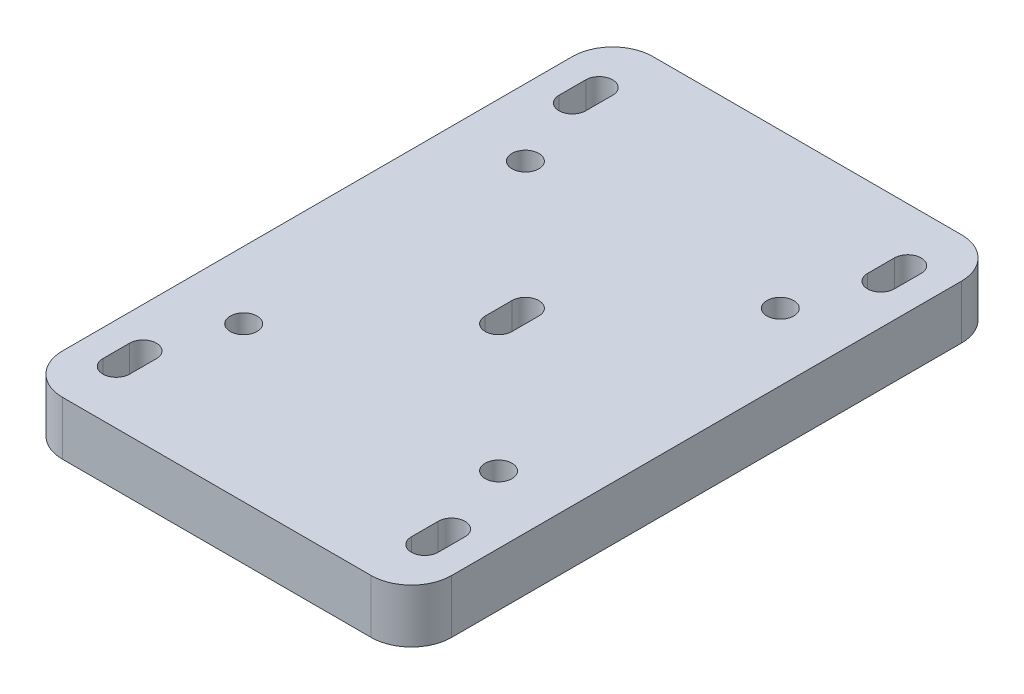
ISO-10303-21;
HEADER;
FILE_DESCRIPTION(('STEP AP214'),'2;1');
FILE_NAME('part.step','',(''),(''),'','','');
FILE_SCHEMA(('AUTOMOTIVE_DESIGN { 1 0 10303 214 1 1 1 1 }'));
ENDSEC;
DATA;
#1=APPLICATION_CONTEXT('core data for automotive mechanical design processes');
#2=APPLICATION_PROTOCOL_DEFINITION('international standard','automotive_design',2000,#1);
#3=PRODUCT_CONTEXT('',#1,'mechanical');
#4=PRODUCT('Part','Part','',(#3));
#5=PRODUCT_RELATED_PRODUCT_CATEGORY('part','',(#4));
#6=PRODUCT_DEFINITION_FORMATION('','',#4);
#7=PRODUCT_DEFINITION_CONTEXT('part definition',#1,'design');
#8=PRODUCT_DEFINITION('design','',#6,#7);
#9=PRODUCT_DEFINITION_SHAPE('','',#8);
#10=(LENGTH_UNIT() NAMED_UNIT(*) SI_UNIT(.MILLI.,.METRE.));
#11=(NAMED_UNIT(*) PLANE_ANGLE_UNIT() SI_UNIT($,.RADIAN.));
#12=(NAMED_UNIT(*) SI_UNIT($,.STERADIAN.) SOLID_ANGLE_UNIT());
#13=UNCERTAINTY_MEASURE_WITH_UNIT(LENGTH_MEASURE(1.E-05),#10,'distance_accuracy_value','');
#14=(GEOMETRIC_REPRESENTATION_CONTEXT(3) GLOBAL_UNCERTAINTY_ASSIGNED_CONTEXT((#13)) GLOBAL_UNIT_ASSIGNED_CONTEXT((#10,
#11,#12)) REPRESENTATION_CONTEXT('',''));
#15=CARTESIAN_POINT('',(0.,0.,0.));
#16=DIRECTION('',(0.,0.,1.));
#17=DIRECTION('',(1.,0.,0.));
#18=AXIS2_PLACEMENT_3D('',#15,#16,#17);
#19=CARTESIAN_POINT('',(0.,12.7,0.));
#20=DIRECTION('',(1.,0.,0.));
#21=DIRECTION('',(0.,0.,-1.));
#22=AXIS2_PLACEMENT_3D('',#19,#20,#21);
#23=PLANE('',#22);
#24=DIRECTION('',(0.,0.,1.));
#25=VECTOR('',#24,1.);
#26=CARTESIAN_POINT('',(0.,0.,0.));
#27=LINE('',#26,#25);
#28=CARTESIAN_POINT('',(0.,0.,-130.175));
#29=VERTEX_POINT('',#28);
#30=CARTESIAN_POINT('',(0.,0.,-9.525));
#31=VERTEX_POINT('',#30);
#32=EDGE_CURVE('E488',#29,#31,#27,.T.);
#33=ORIENTED_EDGE('',*,*,#32,.T.);
#34=DIRECTION('',(0.,-1.,0.));
#35=VECTOR('',#34,1.);
#36=CARTESIAN_POINT('',(0.,12.7,-9.525));
#37=LINE('',#36,#35);
#38=CARTESIAN_POINT('',(0.,12.7,-9.525));
#39=VERTEX_POINT('',#38);
#40=EDGE_CURVE('E558',#31,#39,#37,.F.);
#41=ORIENTED_EDGE('',*,*,#40,.T.);
#42=DIRECTION('',(0.,0.,1.));
#43=VECTOR('',#42,1.);
#44=CARTESIAN_POINT('',(0.,12.7,0.));
#45=LINE('',#44,#43);
#46=CARTESIAN_POINT('',(0.,12.7,-130.175));
#47=VERTEX_POINT('',#46);
#48=EDGE_CURVE('E489',#47,#39,#45,.T.);
#49=ORIENTED_EDGE('',*,*,#48,.F.);
#50=DIRECTION('',(0.,-1.,0.));
#51=VECTOR('',#50,1.);
#52=CARTESIAN_POINT('',(0.,12.7,-130.175));
#53=LINE('',#52,#51);
#54=EDGE_CURVE('E554',#47,#29,#53,.T.);
#55=ORIENTED_EDGE('',*,*,#54,.T.);
#56=EDGE_LOOP('',(#33,#41,#49,#55));
#57=FACE_BOUND('',#56,.T.);
#58=ADVANCED_FACE('F38',(#57),#23,.F.);
#59=CARTESIAN_POINT('',(0.,12.7,0.));
#60=DIRECTION('',(0.,0.,-1.));
#61=DIRECTION('',(-1.,0.,0.));
#62=AXIS2_PLACEMENT_3D('',#59,#60,#61);
#63=PLANE('',#62);
#64=DIRECTION('',(1.,0.,0.));
#65=VECTOR('',#64,1.);
#66=CARTESIAN_POINT('',(0.,0.,0.));
#67=LINE('',#66,#65);
#68=CARTESIAN_POINT('',(9.525,0.,0.));
#69=VERTEX_POINT('',#68);
#70=CARTESIAN_POINT('',(82.55,0.,0.));
#71=VERTEX_POINT('',#70);
#72=EDGE_CURVE('E508',#69,#71,#67,.T.);
#73=ORIENTED_EDGE('',*,*,#72,.T.);
#74=DIRECTION('',(0.,-1.,0.));
#75=VECTOR('',#74,1.);
#76=CARTESIAN_POINT('',(82.55,12.7,0.));
#77=LINE('',#76,#75);
#78=CARTESIAN_POINT('',(82.55,12.7,0.));
#79=VERTEX_POINT('',#78);
#80=EDGE_CURVE('E540',#71,#79,#77,.F.);
#81=ORIENTED_EDGE('',*,*,#80,.T.);
#82=DIRECTION('',(1.,0.,0.));
#83=VECTOR('',#82,1.);
#84=CARTESIAN_POINT('',(0.,12.7,0.));
#85=LINE('',#84,#83);
#86=CARTESIAN_POINT('',(9.525,12.7,0.));
#87=VERTEX_POINT('',#86);
#88=EDGE_CURVE('E493',#87,#79,#85,.T.);
#89=ORIENTED_EDGE('',*,*,#88,.F.);
#90=DIRECTION('',(0.,-1.,0.));
#91=VECTOR('',#90,1.);
#92=CARTESIAN_POINT('',(9.525,12.7,0.));
#93=LINE('',#92,#91);
#94=EDGE_CURVE('E536',#87,#69,#93,.T.);
#95=ORIENTED_EDGE('',*,*,#94,.T.);
#96=EDGE_LOOP('',(#73,#81,#89,#95));
#97=FACE_BOUND('',#96,.T.);
#98=ADVANCED_FACE('F584',(#97),#63,.F.);
#99=CARTESIAN_POINT('',(92.075,12.7,0.));
#100=DIRECTION('',(-1.,0.,0.));
#101=DIRECTION('',(0.,0.,1.));
#102=AXIS2_PLACEMENT_3D('',#99,#100,#101);
#103=PLANE('',#102);
#104=DIRECTION('',(0.,0.,-1.));
#105=VECTOR('',#104,1.);
#106=CARTESIAN_POINT('',(92.075,12.7,0.));
#107=LINE('',#106,#105);
#108=CARTESIAN_POINT('',(92.075,12.7,-9.525));
#109=VERTEX_POINT('',#108);
#110=CARTESIAN_POINT('',(92.075,12.7,-130.175));
#111=VERTEX_POINT('',#110);
#112=EDGE_CURVE('E498',#109,#111,#107,.T.);
#113=ORIENTED_EDGE('',*,*,#112,.F.);
#114=DIRECTION('',(0.,-1.,0.));
#115=VECTOR('',#114,1.);
#116=CARTESIAN_POINT('',(92.075,12.7,-9.525));
#117=LINE('',#116,#115);
#118=CARTESIAN_POINT('',(92.075,0.,-9.525));
#119=VERTEX_POINT('',#118);
#120=EDGE_CURVE('E520',#109,#119,#117,.T.);
#121=ORIENTED_EDGE('',*,*,#120,.T.);
#122=DIRECTION('',(0.,0.,-1.));
#123=VECTOR('',#122,1.);
#124=CARTESIAN_POINT('',(92.075,0.,0.));
#125=LINE('',#124,#123);
#126=CARTESIAN_POINT('',(92.075,0.,-130.175));
#127=VERTEX_POINT('',#126);
#128=EDGE_CURVE('E512',#119,#127,#125,.T.);
#129=ORIENTED_EDGE('',*,*,#128,.T.);
#130=DIRECTION('',(0.,-1.,0.));
#131=VECTOR('',#130,1.);
#132=CARTESIAN_POINT('',(92.075,12.7,-130.175));
#133=LINE('',#132,#131);
#134=EDGE_CURVE('E504',#127,#111,#133,.F.);
#135=ORIENTED_EDGE('',*,*,#134,.T.);
#136=EDGE_LOOP('',(#113,#121,#129,#135));
#137=FACE_BOUND('',#136,.T.);
#138=ADVANCED_FACE('F592',(#137),#103,.F.);
#139=CARTESIAN_POINT('',(0.,12.7,-139.7));
#140=DIRECTION('',(0.,0.,1.));
#141=DIRECTION('',(1.,0.,0.));
#142=AXIS2_PLACEMENT_3D('',#139,#140,#141);
#143=PLANE('',#142);
#144=DIRECTION('',(-1.,0.,0.));
#145=VECTOR('',#144,1.);
#146=CARTESIAN_POINT('',(0.,0.,-139.7));
#147=LINE('',#146,#145);
#148=CARTESIAN_POINT('',(82.55,0.,-139.7));
#149=VERTEX_POINT('',#148);
#150=CARTESIAN_POINT('',(9.525,0.,-139.7));
#151=VERTEX_POINT('',#150);
#152=EDGE_CURVE('E494',#149,#151,#147,.T.);
#153=ORIENTED_EDGE('',*,*,#152,.T.);
#154=DIRECTION('',(0.,-1.,0.));
#155=VECTOR('',#154,1.);
#156=CARTESIAN_POINT('',(9.525,12.7,-139.7));
#157=LINE('',#156,#155);
#158=CARTESIAN_POINT('',(9.525,12.7,-139.7));
#159=VERTEX_POINT('',#158);
#160=EDGE_CURVE('E11',#151,#159,#157,.F.);
#161=ORIENTED_EDGE('',*,*,#160,.T.);
#162=DIRECTION('',(-1.,0.,0.));
#163=VECTOR('',#162,1.);
#164=CARTESIAN_POINT('',(0.,12.7,-139.7));
#165=LINE('',#164,#163);
#166=CARTESIAN_POINT('',(82.55,12.7,-139.7));
#167=VERTEX_POINT('',#166);
#168=EDGE_CURVE('E501',#167,#159,#165,.T.);
#169=ORIENTED_EDGE('',*,*,#168,.F.);
#170=DIRECTION('',(0.,-1.,0.));
#171=VECTOR('',#170,1.);
#172=CARTESIAN_POINT('',(82.55,12.7,-139.7));
#173=LINE('',#172,#171);
#174=EDGE_CURVE('E47',#167,#149,#173,.T.);
#175=ORIENTED_EDGE('',*,*,#174,.T.);
#176=EDGE_LOOP('',(#153,#161,#169,#175));
#177=FACE_BOUND('',#176,.T.);
#178=ADVANCED_FACE('F564',(#177),#143,.F.);
#179=CARTESIAN_POINT('',(0.,12.7,0.));
#180=DIRECTION('',(0.,-1.,0.));
#181=DIRECTION('',(0.,0.,-1.));
#182=AXIS2_PLACEMENT_3D('',#179,#180,#181);
#183=PLANE('',#182);
#184=DIRECTION('',(0.,0.,1.));
#185=VECTOR('',#184,1.);
#186=CARTESIAN_POINT('',(6.34999999999999,12.7,-19.05));
#187=LINE('',#186,#185);
#188=CARTESIAN_POINT('',(6.34999999999999,12.7,-19.05));
#189=VERTEX_POINT('',#188);
#190=CARTESIAN_POINT('',(6.34999999999999,12.7,-12.7));
#191=VERTEX_POINT('',#190);
#192=EDGE_CURVE('E346',#189,#191,#187,.T.);
#193=ORIENTED_EDGE('',*,*,#192,.F.);
#194=CARTESIAN_POINT('',(9.52499999999999,12.7,-19.05));
#195=DIRECTION('',(0.,1.,0.));
#196=DIRECTION('',(0.,0.,1.));
#197=AXIS2_PLACEMENT_3D('',#194,#195,#196);
#198=CIRCLE('',#197,3.175);
#199=CARTESIAN_POINT('',(12.7,12.7,-19.05));
#200=VERTEX_POINT('',#199);
#201=EDGE_CURVE('E343',#200,#189,#198,.T.);
#202=ORIENTED_EDGE('',*,*,#201,.F.);
#203=DIRECTION('',(0.,0.,-1.));
#204=VECTOR('',#203,1.);
#205=CARTESIAN_POINT('',(12.7,12.7,-19.05));
#206=LINE('',#205,#204);
#207=CARTESIAN_POINT('',(12.7,12.7,-12.7));
#208=VERTEX_POINT('',#207);
#209=EDGE_CURVE('E330',#208,#200,#206,.T.);
#210=ORIENTED_EDGE('',*,*,#209,.F.);
#211=CARTESIAN_POINT('',(9.525,12.7,-12.7));
#212=DIRECTION('',(0.,1.,0.));
#213=DIRECTION('',(0.,0.,1.));
#214=AXIS2_PLACEMENT_3D('',#211,#212,#213);
#215=CIRCLE('',#214,3.175);
#216=EDGE_CURVE('E350',#191,#208,#215,.T.);
#217=ORIENTED_EDGE('',*,*,#216,.F.);
#218=EDGE_LOOP('',(#193,#202,#210,#217));
#219=FACE_BOUND('',#218,.T.);
#220=DIRECTION('',(0.,0.,1.));
#221=VECTOR('',#220,1.);
#222=CARTESIAN_POINT('',(79.375,12.7,-19.05));
#223=LINE('',#222,#221);
#224=CARTESIAN_POINT('',(79.375,12.7,-19.05));
#225=VERTEX_POINT('',#224);
#226=CARTESIAN_POINT('',(79.375,12.7,-12.7));
#227=VERTEX_POINT('',#226);
#228=EDGE_CURVE('E302',#225,#227,#223,.T.);
#229=ORIENTED_EDGE('',*,*,#228,.F.);
#230=CARTESIAN_POINT('',(82.55,12.7,-19.05));
#231=DIRECTION('',(0.,1.,0.));
#232=DIRECTION('',(0.,0.,1.));
#233=AXIS2_PLACEMENT_3D('',#230,#231,#232);
#234=CIRCLE('',#233,3.175);
#235=CARTESIAN_POINT('',(85.7250000000001,12.7,-19.05));
#236=VERTEX_POINT('',#235);
#237=EDGE_CURVE('E299',#236,#225,#234,.T.);
#238=ORIENTED_EDGE('',*,*,#237,.F.);
#239=DIRECTION('',(0.,0.,-1.));
#240=VECTOR('',#239,1.);
#241=CARTESIAN_POINT('',(85.7250000000001,12.7,-19.05));
#242=LINE('',#241,#240);
#243=CARTESIAN_POINT('',(85.7250000000001,12.7,-12.7));
#244=VERTEX_POINT('',#243);
#245=EDGE_CURVE('E286',#244,#236,#242,.T.);
#246=ORIENTED_EDGE('',*,*,#245,.F.);
#247=CARTESIAN_POINT('',(82.55,12.7,-12.7));
#248=DIRECTION('',(0.,1.,0.));
#249=DIRECTION('',(0.,0.,1.));
#250=AXIS2_PLACEMENT_3D('',#247,#248,#249);
#251=CIRCLE('',#250,3.175);
#252=EDGE_CURVE('E307',#227,#244,#251,.T.);
#253=ORIENTED_EDGE('',*,*,#252,.F.);
#254=EDGE_LOOP('',(#229,#238,#246,#253));
#255=FACE_BOUND('',#254,.T.);
#256=DIRECTION('',(0.,0.,1.));
#257=VECTOR('',#256,1.);
#258=CARTESIAN_POINT('',(79.375,12.7,-127.));
#259=LINE('',#258,#257);
#260=CARTESIAN_POINT('',(79.375,12.7,-127.));
#261=VERTEX_POINT('',#260);
#262=CARTESIAN_POINT('',(79.375,12.7,-120.65));
#263=VERTEX_POINT('',#262);
#264=EDGE_CURVE('E265',#261,#263,#259,.T.);
#265=ORIENTED_EDGE('',*,*,#264,.F.);
#266=CARTESIAN_POINT('',(82.55,12.7,-127.));
#267=DIRECTION('',(0.,1.,0.));
#268=DIRECTION('',(0.,0.,1.));
#269=AXIS2_PLACEMENT_3D('',#266,#267,#268);
#270=CIRCLE('',#269,3.175);
#271=CARTESIAN_POINT('',(85.7250000000001,12.7,-127.));
#272=VERTEX_POINT('',#271);
#273=EDGE_CURVE('E231',#272,#261,#270,.T.);
#274=ORIENTED_EDGE('',*,*,#273,.F.);
#275=DIRECTION('',(0.,0.,-1.));
#276=VECTOR('',#275,1.);
#277=CARTESIAN_POINT('',(85.7250000000001,12.7,-127.));
#278=LINE('',#277,#276);
#279=CARTESIAN_POINT('',(85.7250000000001,12.7,-120.65));
#280=VERTEX_POINT('',#279);
#281=EDGE_CURVE('E252',#280,#272,#278,.T.);
#282=ORIENTED_EDGE('',*,*,#281,.F.);
#283=CARTESIAN_POINT('',(82.55,12.7,-120.65));
#284=DIRECTION('',(0.,1.,0.));
#285=DIRECTION('',(0.,0.,1.));
#286=AXIS2_PLACEMENT_3D('',#283,#284,#285);
#287=CIRCLE('',#286,3.175);
#288=EDGE_CURVE('E256',#263,#280,#287,.T.);
#289=ORIENTED_EDGE('',*,*,#288,.F.);
#290=EDGE_LOOP('',(#265,#274,#282,#289));
#291=FACE_BOUND('',#290,.T.);
#292=DIRECTION('',(0.,0.,1.));
#293=VECTOR('',#292,1.);
#294=CARTESIAN_POINT('',(6.34999999999999,12.7,-127.));
#295=LINE('',#294,#293);
#296=CARTESIAN_POINT('',(6.34999999999999,12.7,-127.));
#297=VERTEX_POINT('',#296);
#298=CARTESIAN_POINT('',(6.34999999999999,12.7,-120.65));
#299=VERTEX_POINT('',#298);
#300=EDGE_CURVE('E433',#297,#299,#295,.T.);
#301=ORIENTED_EDGE('',*,*,#300,.F.);
#302=CARTESIAN_POINT('',(9.52499999999999,12.7,-127.));
#303=DIRECTION('',(0.,1.,0.));
#304=DIRECTION('',(0.,0.,1.));
#305=AXIS2_PLACEMENT_3D('',#302,#303,#304);
#306=CIRCLE('',#305,3.175);
#307=CARTESIAN_POINT('',(12.7,12.7,-127.));
#308=VERTEX_POINT('',#307);
#309=EDGE_CURVE('E401',#308,#297,#306,.T.);
#310=ORIENTED_EDGE('',*,*,#309,.F.);
#311=DIRECTION('',(0.,0.,-1.));
#312=VECTOR('',#311,1.);
#313=CARTESIAN_POINT('',(12.7,12.7,-127.));
#314=LINE('',#313,#312);
#315=CARTESIAN_POINT('',(12.7,12.7,-120.65));
#316=VERTEX_POINT('',#315);
#317=EDGE_CURVE('E418',#316,#308,#314,.T.);
#318=ORIENTED_EDGE('',*,*,#317,.F.);
#319=CARTESIAN_POINT('',(9.525,12.7,-120.65));
#320=DIRECTION('',(0.,1.,0.));
#321=DIRECTION('',(0.,0.,1.));
#322=AXIS2_PLACEMENT_3D('',#319,#320,#321);
#323=CIRCLE('',#322,3.175);
#324=EDGE_CURVE('E437',#299,#316,#323,.T.);
#325=ORIENTED_EDGE('',*,*,#324,.F.);
#326=EDGE_LOOP('',(#301,#310,#318,#325));
#327=FACE_BOUND('',#326,.T.);
#328=DIRECTION('',(0.,0.,1.));
#329=VECTOR('',#328,1.);
#330=CARTESIAN_POINT('',(42.8625,12.7,-73.025));
#331=LINE('',#330,#329);
#332=CARTESIAN_POINT('',(42.8625,12.7,-73.025));
#333=VERTEX_POINT('',#332);
#334=CARTESIAN_POINT('',(42.8625,12.7,-66.675));
#335=VERTEX_POINT('',#334);
#336=EDGE_CURVE('E388',#333,#335,#331,.T.);
#337=ORIENTED_EDGE('',*,*,#336,.F.);
#338=CARTESIAN_POINT('',(46.0375,12.7,-73.025));
#339=DIRECTION('',(0.,1.,0.));
#340=DIRECTION('',(0.,0.,1.));
#341=AXIS2_PLACEMENT_3D('',#338,#339,#340);
#342=CIRCLE('',#341,3.175);
#343=CARTESIAN_POINT('',(49.2125,12.7,-73.025));
#344=VERTEX_POINT('',#343);
#345=EDGE_CURVE('E275',#344,#333,#342,.T.);
#346=ORIENTED_EDGE('',*,*,#345,.F.);
#347=DIRECTION('',(0.,0.,-1.));
#348=VECTOR('',#347,1.);
#349=CARTESIAN_POINT('',(49.2125,12.7,-73.025));
#350=LINE('',#349,#348);
#351=CARTESIAN_POINT('',(49.2125,12.7,-66.675));
#352=VERTEX_POINT('',#351);
#353=EDGE_CURVE('E373',#352,#344,#350,.T.);
#354=ORIENTED_EDGE('',*,*,#353,.F.);
#355=CARTESIAN_POINT('',(46.0375,12.7,-66.675));
#356=DIRECTION('',(0.,1.,0.));
#357=DIRECTION('',(0.,0.,1.));
#358=AXIS2_PLACEMENT_3D('',#355,#356,#357);
#359=CIRCLE('',#358,3.175);
#360=EDGE_CURVE('E391',#335,#352,#359,.T.);
#361=ORIENTED_EDGE('',*,*,#360,.F.);
#362=EDGE_LOOP('',(#337,#346,#354,#361));
#363=FACE_BOUND('',#362,.T.);
#364=CARTESIAN_POINT('',(76.2,12.7,-103.1875));
#365=DIRECTION('',(0.,1.,0.));
#366=DIRECTION('',(0.,0.,1.));
#367=AXIS2_PLACEMENT_3D('',#364,#365,#366);
#368=CIRCLE('',#367,3.175);
#369=CARTESIAN_POINT('',(76.2,12.7,-100.0125));
#370=VERTEX_POINT('',#369);
#371=EDGE_CURVE('E447',#370,#370,#368,.T.);
#372=ORIENTED_EDGE('',*,*,#371,.F.);
#373=EDGE_LOOP('',(#372));
#374=FACE_BOUND('',#373,.T.);
#375=CARTESIAN_POINT('',(15.875,12.7,-36.5125));
#376=DIRECTION('',(0.,1.,0.));
#377=DIRECTION('',(0.,0.,1.));
#378=AXIS2_PLACEMENT_3D('',#375,#376,#377);
#379=CIRCLE('',#378,3.175);
#380=CARTESIAN_POINT('',(15.875,12.7,-33.3375));
#381=VERTEX_POINT('',#380);
#382=EDGE_CURVE('E464',#381,#381,#379,.T.);
#383=ORIENTED_EDGE('',*,*,#382,.F.);
#384=EDGE_LOOP('',(#383));
#385=FACE_BOUND('',#384,.T.);
#386=CARTESIAN_POINT('',(15.875,12.7,-103.1875));
#387=DIRECTION('',(0.,1.,0.));
#388=DIRECTION('',(0.,0.,1.));
#389=AXIS2_PLACEMENT_3D('',#386,#387,#388);
#390=CIRCLE('',#389,3.175);
#391=CARTESIAN_POINT('',(15.875,12.7,-100.0125));
#392=VERTEX_POINT('',#391);
#393=EDGE_CURVE('E472',#392,#392,#390,.T.);
#394=ORIENTED_EDGE('',*,*,#393,.F.);
#395=EDGE_LOOP('',(#394));
#396=FACE_BOUND('',#395,.T.);
#397=CARTESIAN_POINT('',(76.2,12.7,-36.5125));
#398=DIRECTION('',(0.,1.,0.));
#399=DIRECTION('',(0.,0.,1.));
#400=AXIS2_PLACEMENT_3D('',#397,#398,#399);
#401=CIRCLE('',#400,3.175);
#402=CARTESIAN_POINT('',(76.2,12.7,-33.3375));
#403=VERTEX_POINT('',#402);
#404=EDGE_CURVE('E480',#403,#403,#401,.T.);
#405=ORIENTED_EDGE('',*,*,#404,.F.);
#406=EDGE_LOOP('',(#405));
#407=FACE_BOUND('',#406,.T.);
#408=ORIENTED_EDGE('',*,*,#88,.T.);
#409=CARTESIAN_POINT('',(82.55,12.7,-9.525));
#410=DIRECTION('',(0.,-1.,0.));
#411=DIRECTION('',(0.,0.,-1.));
#412=AXIS2_PLACEMENT_3D('',#409,#410,#411);
#413=CIRCLE('',#412,9.525);
#414=EDGE_CURVE('E551',#79,#109,#413,.F.);
#415=ORIENTED_EDGE('',*,*,#414,.T.);
#416=ORIENTED_EDGE('',*,*,#112,.T.);
#417=CARTESIAN_POINT('',(82.55,12.7,-130.175));
#418=DIRECTION('',(0.,-1.,0.));
#419=DIRECTION('',(0.,0.,-1.));
#420=AXIS2_PLACEMENT_3D('',#417,#418,#419);
#421=CIRCLE('',#420,9.525);
#422=EDGE_CURVE('E59',#111,#167,#421,.F.);
#423=ORIENTED_EDGE('',*,*,#422,.T.);
#424=ORIENTED_EDGE('',*,*,#168,.T.);
#425=CARTESIAN_POINT('',(9.525,12.7,-130.175));
#426=DIRECTION('',(0.,-1.,0.));
#427=DIRECTION('',(0.,0.,-1.));
#428=AXIS2_PLACEMENT_3D('',#425,#426,#427);
#429=CIRCLE('',#428,9.525);
#430=EDGE_CURVE('E545',#159,#47,#429,.F.);
#431=ORIENTED_EDGE('',*,*,#430,.T.);
#432=ORIENTED_EDGE('',*,*,#48,.T.);
#433=CARTESIAN_POINT('',(9.525,12.7,-9.525));
#434=DIRECTION('',(0.,-1.,0.));
#435=DIRECTION('',(0.,0.,-1.));
#436=AXIS2_PLACEMENT_3D('',#433,#434,#435);
#437=CIRCLE('',#436,9.525);
#438=EDGE_CURVE('E548',#39,#87,#437,.F.);
#439=ORIENTED_EDGE('',*,*,#438,.T.);
#440=EDGE_LOOP('',(#408,#415,#416,#423,#424,#431,#432,#439));
#441=FACE_BOUND('',#440,.T.);
#442=ADVANCED_FACE('F577',(#219,#255,#291,#327,#363,#374,#385,#396,#407,#441),#183,.F.);
#443=CARTESIAN_POINT('',(0.,0.,0.));
#444=DIRECTION('',(0.,-1.,0.));
#445=DIRECTION('',(0.,0.,-1.));
#446=AXIS2_PLACEMENT_3D('',#443,#444,#445);
#447=PLANE('',#446);
#448=CARTESIAN_POINT('',(9.52499999999999,0.,-19.05));
#449=DIRECTION('',(0.,1.,0.));
#450=DIRECTION('',(0.,0.,1.));
#451=AXIS2_PLACEMENT_3D('',#448,#449,#450);
#452=CIRCLE('',#451,3.175);
#453=CARTESIAN_POINT('',(12.7,0.,-19.05));
#454=VERTEX_POINT('',#453);
#455=CARTESIAN_POINT('',(6.34999999999999,0.,-19.05));
#456=VERTEX_POINT('',#455);
#457=EDGE_CURVE('E325',#454,#456,#452,.T.);
#458=ORIENTED_EDGE('',*,*,#457,.T.);
#459=DIRECTION('',(0.,0.,1.));
#460=VECTOR('',#459,1.);
#461=CARTESIAN_POINT('',(6.34999999999999,0.,-19.05));
#462=LINE('',#461,#460);
#463=CARTESIAN_POINT('',(6.35,0.,-12.7));
#464=VERTEX_POINT('',#463);
#465=EDGE_CURVE('E329',#456,#464,#462,.T.);
#466=ORIENTED_EDGE('',*,*,#465,.T.);
#467=CARTESIAN_POINT('',(9.525,0.,-12.7));
#468=DIRECTION('',(0.,1.,0.));
#469=DIRECTION('',(0.,0.,1.));
#470=AXIS2_PLACEMENT_3D('',#467,#468,#469);
#471=CIRCLE('',#470,3.175);
#472=CARTESIAN_POINT('',(12.7,0.,-12.7));
#473=VERTEX_POINT('',#472);
#474=EDGE_CURVE('E334',#464,#473,#471,.T.);
#475=ORIENTED_EDGE('',*,*,#474,.T.);
#476=DIRECTION('',(0.,0.,-1.));
#477=VECTOR('',#476,1.);
#478=CARTESIAN_POINT('',(12.7,0.,-19.05));
#479=LINE('',#478,#477);
#480=EDGE_CURVE('E338',#473,#454,#479,.T.);
#481=ORIENTED_EDGE('',*,*,#480,.T.);
#482=EDGE_LOOP('',(#458,#466,#475,#481));
#483=FACE_BOUND('',#482,.T.);
#484=CARTESIAN_POINT('',(82.55,0.,-19.05));
#485=DIRECTION('',(0.,1.,0.));
#486=DIRECTION('',(0.,0.,1.));
#487=AXIS2_PLACEMENT_3D('',#484,#485,#486);
#488=CIRCLE('',#487,3.175);
#489=CARTESIAN_POINT('',(85.7250000000001,0.,-19.05));
#490=VERTEX_POINT('',#489);
#491=CARTESIAN_POINT('',(79.375,0.,-19.05));
#492=VERTEX_POINT('',#491);
#493=EDGE_CURVE('E281',#490,#492,#488,.T.);
#494=ORIENTED_EDGE('',*,*,#493,.T.);
#495=DIRECTION('',(0.,0.,1.));
#496=VECTOR('',#495,1.);
#497=CARTESIAN_POINT('',(79.375,0.,-19.05));
#498=LINE('',#497,#496);
#499=CARTESIAN_POINT('',(79.375,0.,-12.7));
#500=VERTEX_POINT('',#499);
#501=EDGE_CURVE('E285',#492,#500,#498,.T.);
#502=ORIENTED_EDGE('',*,*,#501,.T.);
#503=CARTESIAN_POINT('',(82.55,0.,-12.7));
#504=DIRECTION('',(0.,1.,0.));
#505=DIRECTION('',(0.,0.,1.));
#506=AXIS2_PLACEMENT_3D('',#503,#504,#505);
#507=CIRCLE('',#506,3.175);
#508=CARTESIAN_POINT('',(85.7250000000001,0.,-12.7));
#509=VERTEX_POINT('',#508);
#510=EDGE_CURVE('E290',#500,#509,#507,.T.);
#511=ORIENTED_EDGE('',*,*,#510,.T.);
#512=DIRECTION('',(0.,0.,-1.));
#513=VECTOR('',#512,1.);
#514=CARTESIAN_POINT('',(85.7250000000001,0.,-19.05));
#515=LINE('',#514,#513);
#516=EDGE_CURVE('E294',#509,#490,#515,.T.);
#517=ORIENTED_EDGE('',*,*,#516,.T.);
#518=EDGE_LOOP('',(#494,#502,#511,#517));
#519=FACE_BOUND('',#518,.T.);
#520=CARTESIAN_POINT('',(82.55,0.,-127.));
#521=DIRECTION('',(0.,1.,0.));
#522=DIRECTION('',(0.,0.,1.));
#523=AXIS2_PLACEMENT_3D('',#520,#521,#522);
#524=CIRCLE('',#523,3.175);
#525=CARTESIAN_POINT('',(85.7250000000001,0.,-127.));
#526=VERTEX_POINT('',#525);
#527=CARTESIAN_POINT('',(79.375,0.,-127.));
#528=VERTEX_POINT('',#527);
#529=EDGE_CURVE('E228',#526,#528,#524,.T.);
#530=ORIENTED_EDGE('',*,*,#529,.T.);
#531=DIRECTION('',(0.,0.,1.));
#532=VECTOR('',#531,1.);
#533=CARTESIAN_POINT('',(79.375,0.,-127.));
#534=LINE('',#533,#532);
#535=CARTESIAN_POINT('',(79.375,0.,-120.65));
#536=VERTEX_POINT('',#535);
#537=EDGE_CURVE('E241',#528,#536,#534,.T.);
#538=ORIENTED_EDGE('',*,*,#537,.T.);
#539=CARTESIAN_POINT('',(82.55,0.,-120.65));
#540=DIRECTION('',(0.,1.,0.));
#541=DIRECTION('',(0.,0.,1.));
#542=AXIS2_PLACEMENT_3D('',#539,#540,#541);
#543=CIRCLE('',#542,3.175);
#544=CARTESIAN_POINT('',(85.7250000000001,0.,-120.65));
#545=VERTEX_POINT('',#544);
#546=EDGE_CURVE('E246',#536,#545,#543,.T.);
#547=ORIENTED_EDGE('',*,*,#546,.T.);
#548=DIRECTION('',(0.,0.,-1.));
#549=VECTOR('',#548,1.);
#550=CARTESIAN_POINT('',(85.7250000000001,0.,-127.));
#551=LINE('',#550,#549);
#552=EDGE_CURVE('E237',#545,#526,#551,.T.);
#553=ORIENTED_EDGE('',*,*,#552,.T.);
#554=EDGE_LOOP('',(#530,#538,#547,#553));
#555=FACE_BOUND('',#554,.T.);
#556=CARTESIAN_POINT('',(46.0375,0.,-73.025));
#557=DIRECTION('',(0.,1.,0.));
#558=DIRECTION('',(0.,0.,1.));
#559=AXIS2_PLACEMENT_3D('',#556,#557,#558);
#560=CIRCLE('',#559,3.175);
#561=CARTESIAN_POINT('',(49.2125,0.,-73.025));
#562=VERTEX_POINT('',#561);
#563=CARTESIAN_POINT('',(42.8625,0.,-73.025));
#564=VERTEX_POINT('',#563);
#565=EDGE_CURVE('E368',#562,#564,#560,.T.);
#566=ORIENTED_EDGE('',*,*,#565,.T.);
#567=DIRECTION('',(0.,0.,1.));
#568=VECTOR('',#567,1.);
#569=CARTESIAN_POINT('',(42.8625,0.,-73.025));
#570=LINE('',#569,#568);
#571=CARTESIAN_POINT('',(42.8625,0.,-66.675));
#572=VERTEX_POINT('',#571);
#573=EDGE_CURVE('E372',#564,#572,#570,.T.);
#574=ORIENTED_EDGE('',*,*,#573,.T.);
#575=CARTESIAN_POINT('',(46.0375,0.,-66.675));
#576=DIRECTION('',(0.,1.,0.));
#577=DIRECTION('',(0.,0.,1.));
#578=AXIS2_PLACEMENT_3D('',#575,#576,#577);
#579=CIRCLE('',#578,3.175);
#580=CARTESIAN_POINT('',(49.2125,0.,-66.675));
#581=VERTEX_POINT('',#580);
#582=EDGE_CURVE('E377',#572,#581,#579,.T.);
#583=ORIENTED_EDGE('',*,*,#582,.T.);
#584=DIRECTION('',(0.,0.,-1.));
#585=VECTOR('',#584,1.);
#586=CARTESIAN_POINT('',(49.2125,0.,-73.025));
#587=LINE('',#586,#585);
#588=EDGE_CURVE('E381',#581,#562,#587,.T.);
#589=ORIENTED_EDGE('',*,*,#588,.T.);
#590=EDGE_LOOP('',(#566,#574,#583,#589));
#591=FACE_BOUND('',#590,.T.);
#592=CARTESIAN_POINT('',(9.52499999999999,0.,-127.));
#593=DIRECTION('',(0.,1.,0.));
#594=DIRECTION('',(0.,0.,1.));
#595=AXIS2_PLACEMENT_3D('',#592,#593,#594);
#596=CIRCLE('',#595,3.175);
#597=CARTESIAN_POINT('',(12.7,0.,-127.));
#598=VERTEX_POINT('',#597);
#599=CARTESIAN_POINT('',(6.34999999999999,0.,-127.));
#600=VERTEX_POINT('',#599);
#601=EDGE_CURVE('E413',#598,#600,#596,.T.);
#602=ORIENTED_EDGE('',*,*,#601,.T.);
#603=DIRECTION('',(0.,0.,1.));
#604=VECTOR('',#603,1.);
#605=CARTESIAN_POINT('',(6.34999999999999,0.,-127.));
#606=LINE('',#605,#604);
#607=CARTESIAN_POINT('',(6.35,0.,-120.65));
#608=VERTEX_POINT('',#607);
#609=EDGE_CURVE('E417',#600,#608,#606,.T.);
#610=ORIENTED_EDGE('',*,*,#609,.T.);
#611=CARTESIAN_POINT('',(9.525,0.,-120.65));
#612=DIRECTION('',(0.,1.,0.));
#613=DIRECTION('',(0.,0.,1.));
#614=AXIS2_PLACEMENT_3D('',#611,#612,#613);
#615=CIRCLE('',#614,3.175);
#616=CARTESIAN_POINT('',(12.7,0.,-120.65));
#617=VERTEX_POINT('',#616);
#618=EDGE_CURVE('E422',#608,#617,#615,.T.);
#619=ORIENTED_EDGE('',*,*,#618,.T.);
#620=DIRECTION('',(0.,0.,-1.));
#621=VECTOR('',#620,1.);
#622=CARTESIAN_POINT('',(12.7,0.,-127.));
#623=LINE('',#622,#621);
#624=EDGE_CURVE('E426',#617,#598,#623,.T.);
#625=ORIENTED_EDGE('',*,*,#624,.T.);
#626=EDGE_LOOP('',(#602,#610,#619,#625));
#627=FACE_BOUND('',#626,.T.);
#628=CARTESIAN_POINT('',(76.2,0.,-103.1875));
#629=DIRECTION('',(0.,1.,0.));
#630=DIRECTION('',(0.,0.,1.));
#631=AXIS2_PLACEMENT_3D('',#628,#629,#630);
#632=CIRCLE('',#631,3.175);
#633=CARTESIAN_POINT('',(76.2,0.,-100.0125));
#634=VERTEX_POINT('',#633);
#635=EDGE_CURVE('E460',#634,#634,#632,.T.);
#636=ORIENTED_EDGE('',*,*,#635,.T.);
#637=EDGE_LOOP('',(#636));
#638=FACE_BOUND('',#637,.T.);
#639=CARTESIAN_POINT('',(15.875,0.,-36.5125));
#640=DIRECTION('',(0.,1.,0.));
#641=DIRECTION('',(0.,0.,1.));
#642=AXIS2_PLACEMENT_3D('',#639,#640,#641);
#643=CIRCLE('',#642,3.175);
#644=CARTESIAN_POINT('',(15.875,0.,-33.3375));
#645=VERTEX_POINT('',#644);
#646=EDGE_CURVE('E468',#645,#645,#643,.T.);
#647=ORIENTED_EDGE('',*,*,#646,.T.);
#648=EDGE_LOOP('',(#647));
#649=FACE_BOUND('',#648,.T.);
#650=CARTESIAN_POINT('',(15.875,0.,-103.1875));
#651=DIRECTION('',(0.,1.,0.));
#652=DIRECTION('',(0.,0.,1.));
#653=AXIS2_PLACEMENT_3D('',#650,#651,#652);
#654=CIRCLE('',#653,3.175);
#655=CARTESIAN_POINT('',(15.875,0.,-100.0125));
#656=VERTEX_POINT('',#655);
#657=EDGE_CURVE('E476',#656,#656,#654,.T.);
#658=ORIENTED_EDGE('',*,*,#657,.T.);
#659=EDGE_LOOP('',(#658));
#660=FACE_BOUND('',#659,.T.);
#661=CARTESIAN_POINT('',(76.2,0.,-36.5125));
#662=DIRECTION('',(0.,1.,0.));
#663=DIRECTION('',(0.,0.,1.));
#664=AXIS2_PLACEMENT_3D('',#661,#662,#663);
#665=CIRCLE('',#664,3.175);
#666=CARTESIAN_POINT('',(76.2,0.,-33.3375));
#667=VERTEX_POINT('',#666);
#668=EDGE_CURVE('E484',#667,#667,#665,.T.);
#669=ORIENTED_EDGE('',*,*,#668,.T.);
#670=EDGE_LOOP('',(#669));
#671=FACE_BOUND('',#670,.T.);
#672=ORIENTED_EDGE('',*,*,#128,.F.);
#673=CARTESIAN_POINT('',(82.55,0.,-9.525));
#674=DIRECTION('',(0.,-1.,0.));
#675=DIRECTION('',(0.,0.,-1.));
#676=AXIS2_PLACEMENT_3D('',#673,#674,#675);
#677=CIRCLE('',#676,9.525);
#678=EDGE_CURVE('E533',#119,#71,#677,.T.);
#679=ORIENTED_EDGE('',*,*,#678,.T.);
#680=ORIENTED_EDGE('',*,*,#72,.F.);
#681=CARTESIAN_POINT('',(9.525,0.,-9.525));
#682=DIRECTION('',(0.,-1.,0.));
#683=DIRECTION('',(0.,0.,-1.));
#684=AXIS2_PLACEMENT_3D('',#681,#682,#683);
#685=CIRCLE('',#684,9.525);
#686=EDGE_CURVE('E530',#69,#31,#685,.T.);
#687=ORIENTED_EDGE('',*,*,#686,.T.);
#688=ORIENTED_EDGE('',*,*,#32,.F.);
#689=CARTESIAN_POINT('',(9.525,0.,-130.175));
#690=DIRECTION('',(0.,-1.,0.));
#691=DIRECTION('',(0.,0.,-1.));
#692=AXIS2_PLACEMENT_3D('',#689,#690,#691);
#693=CIRCLE('',#692,9.525);
#694=EDGE_CURVE('E527',#29,#151,#693,.T.);
#695=ORIENTED_EDGE('',*,*,#694,.T.);
#696=ORIENTED_EDGE('',*,*,#152,.F.);
#697=CARTESIAN_POINT('',(82.55,0.,-130.175));
#698=DIRECTION('',(0.,-1.,0.));
#699=DIRECTION('',(0.,0.,-1.));
#700=AXIS2_PLACEMENT_3D('',#697,#698,#699);
#701=CIRCLE('',#700,9.525);
#702=EDGE_CURVE('E524',#149,#127,#701,.T.);
#703=ORIENTED_EDGE('',*,*,#702,.T.);
#704=EDGE_LOOP('',(#672,#679,#680,#687,#688,#695,#696,#703));
#705=FACE_BOUND('',#704,.T.);
#706=ADVANCED_FACE('F248',(#483,#519,#555,#591,#627,#638,#649,#660,#671,#705),#447,.T.);
#707=CARTESIAN_POINT('',(76.2,12.7,-36.5125));
#708=DIRECTION('',(0.,1.,0.));
#709=DIRECTION('',(0.,0.,1.));
#710=AXIS2_PLACEMENT_3D('',#707,#708,#709);
#711=CYLINDRICAL_SURFACE('',#710,3.175);
#712=ORIENTED_EDGE('',*,*,#668,.F.);
#713=EDGE_LOOP('',(#712));
#714=FACE_BOUND('',#713,.T.);
#715=ORIENTED_EDGE('',*,*,#404,.T.);
#716=EDGE_LOOP('',(#715));
#717=FACE_BOUND('',#716,.T.);
#718=ADVANCED_FACE('F833',(#714,#717),#711,.F.);
#719=CARTESIAN_POINT('',(15.875,12.7,-103.1875));
#720=DIRECTION('',(0.,1.,0.));
#721=DIRECTION('',(0.,0.,1.));
#722=AXIS2_PLACEMENT_3D('',#719,#720,#721);
#723=CYLINDRICAL_SURFACE('',#722,3.175);
#724=ORIENTED_EDGE('',*,*,#657,.F.);
#725=EDGE_LOOP('',(#724));
#726=FACE_BOUND('',#725,.T.);
#727=ORIENTED_EDGE('',*,*,#393,.T.);
#728=EDGE_LOOP('',(#727));
#729=FACE_BOUND('',#728,.T.);
#730=ADVANCED_FACE('F824',(#726,#729),#723,.F.);
#731=CARTESIAN_POINT('',(15.875,12.7,-36.5125));
#732=DIRECTION('',(0.,1.,0.));
#733=DIRECTION('',(0.,0.,1.));
#734=AXIS2_PLACEMENT_3D('',#731,#732,#733);
#735=CYLINDRICAL_SURFACE('',#734,3.175);
#736=ORIENTED_EDGE('',*,*,#646,.F.);
#737=EDGE_LOOP('',(#736));
#738=FACE_BOUND('',#737,.T.);
#739=ORIENTED_EDGE('',*,*,#382,.T.);
#740=EDGE_LOOP('',(#739));
#741=FACE_BOUND('',#740,.T.);
#742=ADVANCED_FACE('F815',(#738,#741),#735,.F.);
#743=CARTESIAN_POINT('',(76.2,12.7,-103.1875));
#744=DIRECTION('',(0.,1.,0.));
#745=DIRECTION('',(0.,0.,1.));
#746=AXIS2_PLACEMENT_3D('',#743,#744,#745);
#747=CYLINDRICAL_SURFACE('',#746,3.175);
#748=ORIENTED_EDGE('',*,*,#635,.F.);
#749=EDGE_LOOP('',(#748));
#750=FACE_BOUND('',#749,.T.);
#751=ORIENTED_EDGE('',*,*,#371,.T.);
#752=EDGE_LOOP('',(#751));
#753=FACE_BOUND('',#752,.T.);
#754=ADVANCED_FACE('F806',(#750,#753),#747,.F.);
#755=CARTESIAN_POINT('',(9.52499999999999,0.,-127.));
#756=DIRECTION('',(0.,1.,0.));
#757=DIRECTION('',(0.,0.,1.));
#758=AXIS2_PLACEMENT_3D('',#755,#756,#757);
#759=CYLINDRICAL_SURFACE('',#758,3.175);
#760=ORIENTED_EDGE('',*,*,#309,.T.);
#761=DIRECTION('',(0.,1.,0.));
#762=VECTOR('',#761,1.);
#763=CARTESIAN_POINT('',(6.34999999999999,0.,-127.));
#764=LINE('',#763,#762);
#765=EDGE_CURVE('E430',#600,#297,#764,.T.);
#766=ORIENTED_EDGE('',*,*,#765,.F.);
#767=ORIENTED_EDGE('',*,*,#601,.F.);
#768=DIRECTION('',(0.,1.,0.));
#769=VECTOR('',#768,1.);
#770=CARTESIAN_POINT('',(12.7,0.,-127.));
#771=LINE('',#770,#769);
#772=EDGE_CURVE('E444',#598,#308,#771,.T.);
#773=ORIENTED_EDGE('',*,*,#772,.T.);
#774=EDGE_LOOP('',(#760,#766,#767,#773));
#775=FACE_BOUND('',#774,.T.);
#776=ADVANCED_FACE('F797',(#775),#759,.F.);
#777=CARTESIAN_POINT('',(12.7,0.,-127.));
#778=DIRECTION('',(1.,0.,0.));
#779=DIRECTION('',(0.,0.,-1.));
#780=AXIS2_PLACEMENT_3D('',#777,#778,#779);
#781=PLANE('',#780);
#782=ORIENTED_EDGE('',*,*,#317,.T.);
#783=ORIENTED_EDGE('',*,*,#772,.F.);
#784=ORIENTED_EDGE('',*,*,#624,.F.);
#785=DIRECTION('',(0.,1.,0.));
#786=VECTOR('',#785,1.);
#787=CARTESIAN_POINT('',(12.7,0.,-120.65));
#788=LINE('',#787,#786);
#789=EDGE_CURVE('E448',#617,#316,#788,.T.);
#790=ORIENTED_EDGE('',*,*,#789,.T.);
#791=EDGE_LOOP('',(#782,#783,#784,#790));
#792=FACE_BOUND('',#791,.T.);
#793=ADVANCED_FACE('F788',(#792),#781,.F.);
#794=CARTESIAN_POINT('',(9.525,0.,-120.65));
#795=DIRECTION('',(0.,1.,0.));
#796=DIRECTION('',(0.,0.,1.));
#797=AXIS2_PLACEMENT_3D('',#794,#795,#796);
#798=CYLINDRICAL_SURFACE('',#797,3.175);
#799=ORIENTED_EDGE('',*,*,#324,.T.);
#800=ORIENTED_EDGE('',*,*,#789,.F.);
#801=ORIENTED_EDGE('',*,*,#618,.F.);
#802=DIRECTION('',(0.,1.,0.));
#803=VECTOR('',#802,1.);
#804=CARTESIAN_POINT('',(6.34999999999999,0.,-120.65));
#805=LINE('',#804,#803);
#806=EDGE_CURVE('E451',#608,#299,#805,.T.);
#807=ORIENTED_EDGE('',*,*,#806,.T.);
#808=EDGE_LOOP('',(#799,#800,#801,#807));
#809=FACE_BOUND('',#808,.T.);
#810=ADVANCED_FACE('F779',(#809),#798,.F.);
#811=CARTESIAN_POINT('',(6.34999999999999,0.,-127.));
#812=DIRECTION('',(-1.,0.,0.));
#813=DIRECTION('',(0.,0.,1.));
#814=AXIS2_PLACEMENT_3D('',#811,#812,#813);
#815=PLANE('',#814);
#816=ORIENTED_EDGE('',*,*,#300,.T.);
#817=ORIENTED_EDGE('',*,*,#806,.F.);
#818=ORIENTED_EDGE('',*,*,#609,.F.);
#819=ORIENTED_EDGE('',*,*,#765,.T.);
#820=EDGE_LOOP('',(#816,#817,#818,#819));
#821=FACE_BOUND('',#820,.T.);
#822=ADVANCED_FACE('F770',(#821),#815,.F.);
#823=CARTESIAN_POINT('',(49.2125,0.,-73.025));
#824=DIRECTION('',(1.,0.,0.));
#825=DIRECTION('',(0.,0.,-1.));
#826=AXIS2_PLACEMENT_3D('',#823,#824,#825);
#827=PLANE('',#826);
#828=ORIENTED_EDGE('',*,*,#353,.T.);
#829=DIRECTION('',(0.,1.,0.));
#830=VECTOR('',#829,1.);
#831=CARTESIAN_POINT('',(49.2125,0.,-73.025));
#832=LINE('',#831,#830);
#833=EDGE_CURVE('E397',#562,#344,#832,.T.);
#834=ORIENTED_EDGE('',*,*,#833,.F.);
#835=ORIENTED_EDGE('',*,*,#588,.F.);
#836=DIRECTION('',(0.,1.,0.));
#837=VECTOR('',#836,1.);
#838=CARTESIAN_POINT('',(49.2125,0.,-66.675));
#839=LINE('',#838,#837);
#840=EDGE_CURVE('E402',#581,#352,#839,.T.);
#841=ORIENTED_EDGE('',*,*,#840,.T.);
#842=EDGE_LOOP('',(#828,#834,#835,#841));
#843=FACE_BOUND('',#842,.T.);
#844=ADVANCED_FACE('F761',(#843),#827,.F.);
#845=CARTESIAN_POINT('',(42.8625,0.,-73.025));
#846=DIRECTION('',(-1.,0.,0.));
#847=DIRECTION('',(0.,0.,1.));
#848=AXIS2_PLACEMENT_3D('',#845,#846,#847);
#849=PLANE('',#848);
#850=ORIENTED_EDGE('',*,*,#336,.T.);
#851=DIRECTION('',(0.,1.,0.));
#852=VECTOR('',#851,1.);
#853=CARTESIAN_POINT('',(42.8625,0.,-66.675));
#854=LINE('',#853,#852);
#855=EDGE_CURVE('E406',#572,#335,#854,.T.);
#856=ORIENTED_EDGE('',*,*,#855,.F.);
#857=ORIENTED_EDGE('',*,*,#573,.F.);
#858=DIRECTION('',(0.,1.,0.));
#859=VECTOR('',#858,1.);
#860=CARTESIAN_POINT('',(42.8625,0.,-73.025));
#861=LINE('',#860,#859);
#862=EDGE_CURVE('E385',#564,#333,#861,.T.);
#863=ORIENTED_EDGE('',*,*,#862,.T.);
#864=EDGE_LOOP('',(#850,#856,#857,#863));
#865=FACE_BOUND('',#864,.T.);
#866=ADVANCED_FACE('F752',(#865),#849,.F.);
#867=CARTESIAN_POINT('',(46.0375,0.,-73.025));
#868=DIRECTION('',(0.,1.,0.));
#869=DIRECTION('',(0.,0.,1.));
#870=AXIS2_PLACEMENT_3D('',#867,#868,#869);
#871=CYLINDRICAL_SURFACE('',#870,3.175);
#872=ORIENTED_EDGE('',*,*,#345,.T.);
#873=ORIENTED_EDGE('',*,*,#862,.F.);
#874=ORIENTED_EDGE('',*,*,#565,.F.);
#875=ORIENTED_EDGE('',*,*,#833,.T.);
#876=EDGE_LOOP('',(#872,#873,#874,#875));
#877=FACE_BOUND('',#876,.T.);
#878=ADVANCED_FACE('F743',(#877),#871,.F.);
#879=CARTESIAN_POINT('',(46.0375,0.,-66.675));
#880=DIRECTION('',(0.,1.,0.));
#881=DIRECTION('',(0.,0.,1.));
#882=AXIS2_PLACEMENT_3D('',#879,#880,#881);
#883=CYLINDRICAL_SURFACE('',#882,3.175);
#884=ORIENTED_EDGE('',*,*,#360,.T.);
#885=ORIENTED_EDGE('',*,*,#840,.F.);
#886=ORIENTED_EDGE('',*,*,#582,.F.);
#887=ORIENTED_EDGE('',*,*,#855,.T.);
#888=EDGE_LOOP('',(#884,#885,#886,#887));
#889=FACE_BOUND('',#888,.T.);
#890=ADVANCED_FACE('F735',(#889),#883,.F.);
#891=CARTESIAN_POINT('',(82.55,0.,-127.));
#892=DIRECTION('',(0.,1.,0.));
#893=DIRECTION('',(0.,0.,1.));
#894=AXIS2_PLACEMENT_3D('',#891,#892,#893);
#895=CYLINDRICAL_SURFACE('',#894,3.175);
#896=ORIENTED_EDGE('',*,*,#273,.T.);
#897=DIRECTION('',(0.,1.,0.));
#898=VECTOR('',#897,1.);
#899=CARTESIAN_POINT('',(79.375,0.,-127.));
#900=LINE('',#899,#898);
#901=EDGE_CURVE('E224',#528,#261,#900,.T.);
#902=ORIENTED_EDGE('',*,*,#901,.F.);
#903=ORIENTED_EDGE('',*,*,#529,.F.);
#904=DIRECTION('',(0.,1.,0.));
#905=VECTOR('',#904,1.);
#906=CARTESIAN_POINT('',(85.7250000000001,0.,-127.));
#907=LINE('',#906,#905);
#908=EDGE_CURVE('E272',#526,#272,#907,.T.);
#909=ORIENTED_EDGE('',*,*,#908,.T.);
#910=EDGE_LOOP('',(#896,#902,#903,#909));
#911=FACE_BOUND('',#910,.T.);
#912=ADVANCED_FACE('F226',(#911),#895,.F.);
#913=CARTESIAN_POINT('',(85.7250000000001,0.,-127.));
#914=DIRECTION('',(1.,0.,0.));
#915=DIRECTION('',(0.,0.,-1.));
#916=AXIS2_PLACEMENT_3D('',#913,#914,#915);
#917=PLANE('',#916);
#918=ORIENTED_EDGE('',*,*,#281,.T.);
#919=ORIENTED_EDGE('',*,*,#908,.F.);
#920=ORIENTED_EDGE('',*,*,#552,.F.);
#921=DIRECTION('',(0.,1.,0.));
#922=VECTOR('',#921,1.);
#923=CARTESIAN_POINT('',(85.7250000000001,0.,-120.65));
#924=LINE('',#923,#922);
#925=EDGE_CURVE('E276',#545,#280,#924,.T.);
#926=ORIENTED_EDGE('',*,*,#925,.T.);
#927=EDGE_LOOP('',(#918,#919,#920,#926));
#928=FACE_BOUND('',#927,.T.);
#929=ADVANCED_FACE('F718',(#928),#917,.F.);
#930=CARTESIAN_POINT('',(82.55,0.,-120.65));
#931=DIRECTION('',(0.,1.,0.));
#932=DIRECTION('',(0.,0.,1.));
#933=AXIS2_PLACEMENT_3D('',#930,#931,#932);
#934=CYLINDRICAL_SURFACE('',#933,3.175);
#935=ORIENTED_EDGE('',*,*,#288,.T.);
#936=ORIENTED_EDGE('',*,*,#925,.F.);
#937=ORIENTED_EDGE('',*,*,#546,.F.);
#938=DIRECTION('',(0.,1.,0.));
#939=VECTOR('',#938,1.);
#940=CARTESIAN_POINT('',(79.375,0.,-120.65));
#941=LINE('',#940,#939);
#942=EDGE_CURVE('E236',#536,#263,#941,.T.);
#943=ORIENTED_EDGE('',*,*,#942,.T.);
#944=EDGE_LOOP('',(#935,#936,#937,#943));
#945=FACE_BOUND('',#944,.T.);
#946=ADVANCED_FACE('F710',(#945),#934,.F.);
#947=CARTESIAN_POINT('',(79.375,0.,-127.));
#948=DIRECTION('',(-1.,0.,0.));
#949=DIRECTION('',(0.,0.,1.));
#950=AXIS2_PLACEMENT_3D('',#947,#948,#949);
#951=PLANE('',#950);
#952=ORIENTED_EDGE('',*,*,#264,.T.);
#953=ORIENTED_EDGE('',*,*,#942,.F.);
#954=ORIENTED_EDGE('',*,*,#537,.F.);
#955=ORIENTED_EDGE('',*,*,#901,.T.);
#956=EDGE_LOOP('',(#952,#953,#954,#955));
#957=FACE_BOUND('',#956,.T.);
#958=ADVANCED_FACE('F242',(#957),#951,.F.);
#959=CARTESIAN_POINT('',(82.55,0.,-19.05));
#960=DIRECTION('',(0.,1.,0.));
#961=DIRECTION('',(0.,0.,1.));
#962=AXIS2_PLACEMENT_3D('',#959,#960,#961);
#963=CYLINDRICAL_SURFACE('',#962,3.175);
#964=ORIENTED_EDGE('',*,*,#237,.T.);
#965=DIRECTION('',(0.,1.,0.));
#966=VECTOR('',#965,1.);
#967=CARTESIAN_POINT('',(79.375,0.,-19.05));
#968=LINE('',#967,#966);
#969=EDGE_CURVE('E298',#492,#225,#968,.T.);
#970=ORIENTED_EDGE('',*,*,#969,.F.);
#971=ORIENTED_EDGE('',*,*,#493,.F.);
#972=DIRECTION('',(0.,1.,0.));
#973=VECTOR('',#972,1.);
#974=CARTESIAN_POINT('',(85.7250000000001,0.,-19.05));
#975=LINE('',#974,#973);
#976=EDGE_CURVE('E266',#490,#236,#975,.T.);
#977=ORIENTED_EDGE('',*,*,#976,.T.);
#978=EDGE_LOOP('',(#964,#970,#971,#977));
#979=FACE_BOUND('',#978,.T.);
#980=ADVANCED_FACE('F693',(#979),#963,.F.);
#981=CARTESIAN_POINT('',(85.7250000000001,0.,-19.05));
#982=DIRECTION('',(1.,0.,0.));
#983=DIRECTION('',(0.,0.,-1.));
#984=AXIS2_PLACEMENT_3D('',#981,#982,#983);
#985=PLANE('',#984);
#986=ORIENTED_EDGE('',*,*,#245,.T.);
#987=ORIENTED_EDGE('',*,*,#976,.F.);
#988=ORIENTED_EDGE('',*,*,#516,.F.);
#989=DIRECTION('',(0.,1.,0.));
#990=VECTOR('',#989,1.);
#991=CARTESIAN_POINT('',(85.7250000000001,0.,-12.7));
#992=LINE('',#991,#990);
#993=EDGE_CURVE('E316',#509,#244,#992,.T.);
#994=ORIENTED_EDGE('',*,*,#993,.T.);
#995=EDGE_LOOP('',(#986,#987,#988,#994));
#996=FACE_BOUND('',#995,.T.);
#997=ADVANCED_FACE('F684',(#996),#985,.F.);
#998=CARTESIAN_POINT('',(82.55,0.,-12.7));
#999=DIRECTION('',(0.,1.,0.));
#1000=DIRECTION('',(0.,0.,1.));
#1001=AXIS2_PLACEMENT_3D('',#998,#999,#1000);
#1002=CYLINDRICAL_SURFACE('',#1001,3.175);
#1003=ORIENTED_EDGE('',*,*,#252,.T.);
#1004=ORIENTED_EDGE('',*,*,#993,.F.);
#1005=ORIENTED_EDGE('',*,*,#510,.F.);
#1006=DIRECTION('',(0.,1.,0.));
#1007=VECTOR('',#1006,1.);
#1008=CARTESIAN_POINT('',(79.375,0.,-12.7));
#1009=LINE('',#1008,#1007);
#1010=EDGE_CURVE('E319',#500,#227,#1009,.T.);
#1011=ORIENTED_EDGE('',*,*,#1010,.T.);
#1012=EDGE_LOOP('',(#1003,#1004,#1005,#1011));
#1013=FACE_BOUND('',#1012,.T.);
#1014=ADVANCED_FACE('F675',(#1013),#1002,.F.);
#1015=CARTESIAN_POINT('',(79.375,0.,-19.05));
#1016=DIRECTION('',(-1.,0.,0.));
#1017=DIRECTION('',(0.,0.,1.));
#1018=AXIS2_PLACEMENT_3D('',#1015,#1016,#1017);
#1019=PLANE('',#1018);
#1020=ORIENTED_EDGE('',*,*,#228,.T.);
#1021=ORIENTED_EDGE('',*,*,#1010,.F.);
#1022=ORIENTED_EDGE('',*,*,#501,.F.);
#1023=ORIENTED_EDGE('',*,*,#969,.T.);
#1024=EDGE_LOOP('',(#1020,#1021,#1022,#1023));
#1025=FACE_BOUND('',#1024,.T.);
#1026=ADVANCED_FACE('F666',(#1025),#1019,.F.);
#1027=CARTESIAN_POINT('',(9.52499999999999,0.,-19.05));
#1028=DIRECTION('',(0.,1.,0.));
#1029=DIRECTION('',(0.,0.,1.));
#1030=AXIS2_PLACEMENT_3D('',#1027,#1028,#1029);
#1031=CYLINDRICAL_SURFACE('',#1030,3.175);
#1032=ORIENTED_EDGE('',*,*,#201,.T.);
#1033=DIRECTION('',(0.,1.,0.));
#1034=VECTOR('',#1033,1.);
#1035=CARTESIAN_POINT('',(6.34999999999999,0.,-19.05));
#1036=LINE('',#1035,#1034);
#1037=EDGE_CURVE('E342',#456,#189,#1036,.T.);
#1038=ORIENTED_EDGE('',*,*,#1037,.F.);
#1039=ORIENTED_EDGE('',*,*,#457,.F.);
#1040=DIRECTION('',(0.,1.,0.));
#1041=VECTOR('',#1040,1.);
#1042=CARTESIAN_POINT('',(12.7,0.,-19.05));
#1043=LINE('',#1042,#1041);
#1044=EDGE_CURVE('E303',#454,#200,#1043,.T.);
#1045=ORIENTED_EDGE('',*,*,#1044,.T.);
#1046=EDGE_LOOP('',(#1032,#1038,#1039,#1045));
#1047=FACE_BOUND('',#1046,.T.);
#1048=ADVANCED_FACE('F657',(#1047),#1031,.F.);
#1049=CARTESIAN_POINT('',(12.7,0.,-19.05));
#1050=DIRECTION('',(1.,0.,0.));
#1051=DIRECTION('',(0.,0.,-1.));
#1052=AXIS2_PLACEMENT_3D('',#1049,#1050,#1051);
#1053=PLANE('',#1052);
#1054=ORIENTED_EDGE('',*,*,#209,.T.);
#1055=ORIENTED_EDGE('',*,*,#1044,.F.);
#1056=ORIENTED_EDGE('',*,*,#480,.F.);
#1057=DIRECTION('',(0.,1.,0.));
#1058=VECTOR('',#1057,1.);
#1059=CARTESIAN_POINT('',(12.7,0.,-12.7));
#1060=LINE('',#1059,#1058);
#1061=EDGE_CURVE('E359',#473,#208,#1060,.T.);
#1062=ORIENTED_EDGE('',*,*,#1061,.T.);
#1063=EDGE_LOOP('',(#1054,#1055,#1056,#1062));
#1064=FACE_BOUND('',#1063,.T.);
#1065=ADVANCED_FACE('F648',(#1064),#1053,.F.);
#1066=CARTESIAN_POINT('',(9.525,0.,-12.7));
#1067=DIRECTION('',(0.,1.,0.));
#1068=DIRECTION('',(0.,0.,1.));
#1069=AXIS2_PLACEMENT_3D('',#1066,#1067,#1068);
#1070=CYLINDRICAL_SURFACE('',#1069,3.175);
#1071=ORIENTED_EDGE('',*,*,#216,.T.);
#1072=ORIENTED_EDGE('',*,*,#1061,.F.);
#1073=ORIENTED_EDGE('',*,*,#474,.F.);
#1074=DIRECTION('',(0.,1.,0.));
#1075=VECTOR('',#1074,1.);
#1076=CARTESIAN_POINT('',(6.34999999999999,0.,-12.7));
#1077=LINE('',#1076,#1075);
#1078=EDGE_CURVE('E362',#464,#191,#1077,.T.);
#1079=ORIENTED_EDGE('',*,*,#1078,.T.);
#1080=EDGE_LOOP('',(#1071,#1072,#1073,#1079));
#1081=FACE_BOUND('',#1080,.T.);
#1082=ADVANCED_FACE('F639',(#1081),#1070,.F.);
#1083=CARTESIAN_POINT('',(6.34999999999999,0.,-19.05));
#1084=DIRECTION('',(-1.,0.,0.));
#1085=DIRECTION('',(0.,0.,1.));
#1086=AXIS2_PLACEMENT_3D('',#1083,#1084,#1085);
#1087=PLANE('',#1086);
#1088=ORIENTED_EDGE('',*,*,#192,.T.);
#1089=ORIENTED_EDGE('',*,*,#1078,.F.);
#1090=ORIENTED_EDGE('',*,*,#465,.F.);
#1091=ORIENTED_EDGE('',*,*,#1037,.T.);
#1092=EDGE_LOOP('',(#1088,#1089,#1090,#1091));
#1093=FACE_BOUND('',#1092,.T.);
#1094=ADVANCED_FACE('F608',(#1093),#1087,.F.);
#1095=CARTESIAN_POINT('',(82.55,12.7,-9.525));
#1096=DIRECTION('',(0.,-1.,0.));
#1097=DIRECTION('',(0.,0.,-1.));
#1098=AXIS2_PLACEMENT_3D('',#1095,#1096,#1097);
#1099=CYLINDRICAL_SURFACE('',#1098,9.525);
#1100=ORIENTED_EDGE('',*,*,#414,.F.);
#1101=ORIENTED_EDGE('',*,*,#80,.F.);
#1102=ORIENTED_EDGE('',*,*,#678,.F.);
#1103=ORIENTED_EDGE('',*,*,#120,.F.);
#1104=EDGE_LOOP('',(#1100,#1101,#1102,#1103));
#1105=FACE_BOUND('',#1104,.T.);
#1106=ADVANCED_FACE('F589',(#1105),#1099,.T.);
#1107=CARTESIAN_POINT('',(9.525,12.7,-9.525));
#1108=DIRECTION('',(0.,-1.,0.));
#1109=DIRECTION('',(0.,0.,-1.));
#1110=AXIS2_PLACEMENT_3D('',#1107,#1108,#1109);
#1111=CYLINDRICAL_SURFACE('',#1110,9.525);
#1112=ORIENTED_EDGE('',*,*,#438,.F.);
#1113=ORIENTED_EDGE('',*,*,#40,.F.);
#1114=ORIENTED_EDGE('',*,*,#686,.F.);
#1115=ORIENTED_EDGE('',*,*,#94,.F.);
#1116=EDGE_LOOP('',(#1112,#1113,#1114,#1115));
#1117=FACE_BOUND('',#1116,.T.);
#1118=ADVANCED_FACE('F581',(#1117),#1111,.T.);
#1119=CARTESIAN_POINT('',(9.525,12.7,-130.175));
#1120=DIRECTION('',(0.,-1.,0.));
#1121=DIRECTION('',(0.,0.,-1.));
#1122=AXIS2_PLACEMENT_3D('',#1119,#1120,#1121);
#1123=CYLINDRICAL_SURFACE('',#1122,9.525);
#1124=ORIENTED_EDGE('',*,*,#430,.F.);
#1125=ORIENTED_EDGE('',*,*,#160,.F.);
#1126=ORIENTED_EDGE('',*,*,#694,.F.);
#1127=ORIENTED_EDGE('',*,*,#54,.F.);
#1128=EDGE_LOOP('',(#1124,#1125,#1126,#1127));
#1129=FACE_BOUND('',#1128,.T.);
#1130=ADVANCED_FACE('F572',(#1129),#1123,.T.);
#1131=CARTESIAN_POINT('',(82.55,12.7,-130.175));
#1132=DIRECTION('',(0.,-1.,0.));
#1133=DIRECTION('',(0.,0.,-1.));
#1134=AXIS2_PLACEMENT_3D('',#1131,#1132,#1133);
#1135=CYLINDRICAL_SURFACE('',#1134,9.525);
#1136=ORIENTED_EDGE('',*,*,#422,.F.);
#1137=ORIENTED_EDGE('',*,*,#134,.F.);
#1138=ORIENTED_EDGE('',*,*,#702,.F.);
#1139=ORIENTED_EDGE('',*,*,#174,.F.);
#1140=EDGE_LOOP('',(#1136,#1137,#1138,#1139));
#1141=FACE_BOUND('',#1140,.T.);
#1142=ADVANCED_FACE('F40',(#1141),#1135,.T.);
#1143=CLOSED_SHELL('',(#58,#98,#138,#178,#442,#706,#718,#730,#742,#754,#776,#793,#810,#822,#844,
#866,#878,#890,#912,#929,#946,#958,#980,#997,#1014,#1026,#1048,#1065,#1082,#1094,#1106,#1118,
#1130,#1142));
#1144=MANIFOLD_SOLID_BREP('B2',#1143);
#1145=ADVANCED_BREP_SHAPE_REPRESENTATION('',(#18,#1144),#14);
#1146=SHAPE_DEFINITION_REPRESENTATION(#9,#1145);
ENDSEC;
END-ISO-10303-21;
